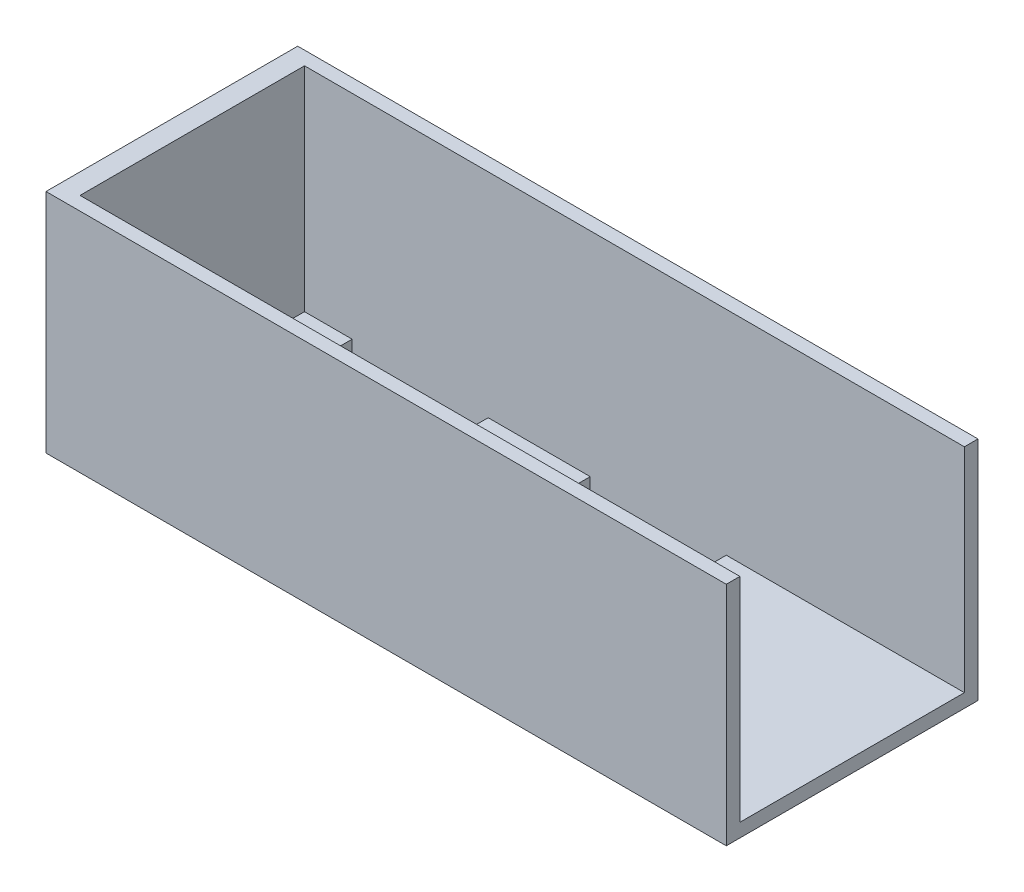
ISO-10303-21;
HEADER;
FILE_DESCRIPTION(('STEP AP214'),'2;1');
FILE_NAME('part.step','',(''),(''),'','','');
FILE_SCHEMA(('AUTOMOTIVE_DESIGN { 1 0 10303 214 1 1 1 1 }'));
ENDSEC;
DATA;
#1=APPLICATION_CONTEXT('core data for automotive mechanical design processes');
#2=APPLICATION_PROTOCOL_DEFINITION('international standard','automotive_design',2000,#1);
#3=PRODUCT_CONTEXT('',#1,'mechanical');
#4=PRODUCT('Part','Part','',(#3));
#5=PRODUCT_RELATED_PRODUCT_CATEGORY('part','',(#4));
#6=PRODUCT_DEFINITION_FORMATION('','',#4);
#7=PRODUCT_DEFINITION_CONTEXT('part definition',#1,'design');
#8=PRODUCT_DEFINITION('design','',#6,#7);
#9=PRODUCT_DEFINITION_SHAPE('','',#8);
#10=(LENGTH_UNIT() NAMED_UNIT(*) SI_UNIT(.MILLI.,.METRE.));
#11=(NAMED_UNIT(*) PLANE_ANGLE_UNIT() SI_UNIT($,.RADIAN.));
#12=(NAMED_UNIT(*) SI_UNIT($,.STERADIAN.) SOLID_ANGLE_UNIT());
#13=UNCERTAINTY_MEASURE_WITH_UNIT(LENGTH_MEASURE(1.E-05),#10,'distance_accuracy_value','');
#14=(GEOMETRIC_REPRESENTATION_CONTEXT(3) GLOBAL_UNCERTAINTY_ASSIGNED_CONTEXT((#13)) GLOBAL_UNIT_ASSIGNED_CONTEXT((#10,
#11,#12)) REPRESENTATION_CONTEXT('',''));
#15=CARTESIAN_POINT('',(0.,0.,0.));
#16=DIRECTION('',(0.,0.,1.));
#17=DIRECTION('',(1.,0.,0.));
#18=AXIS2_PLACEMENT_3D('',#15,#16,#17);
#19=CARTESIAN_POINT('',(50.,0.,-16.));
#20=DIRECTION('',(0.,0.,-1.));
#21=DIRECTION('',(0.,1.,0.));
#22=AXIS2_PLACEMENT_3D('',#19,#20,#21);
#23=PLANE('',#22);
#24=DIRECTION('',(-1.,0.,0.));
#25=VECTOR('',#24,1.);
#26=CARTESIAN_POINT('',(50.,0.,-16.));
#27=LINE('',#26,#25);
#28=CARTESIAN_POINT('',(50.,0.,-16.));
#29=VERTEX_POINT('',#28);
#30=CARTESIAN_POINT('',(-47.,0.,-16.));
#31=VERTEX_POINT('',#30);
#32=EDGE_CURVE('E336',#29,#31,#27,.T.);
#33=ORIENTED_EDGE('',*,*,#32,.T.);
#34=DIRECTION('',(0.,1.,0.));
#35=VECTOR('',#34,1.);
#36=CARTESIAN_POINT('',(-47.,0.,-16.));
#37=LINE('',#36,#35);
#38=CARTESIAN_POINT('',(-47.,-31.3,-16.));
#39=VERTEX_POINT('',#38);
#40=EDGE_CURVE('E293',#39,#31,#37,.T.);
#41=ORIENTED_EDGE('',*,*,#40,.F.);
#42=DIRECTION('',(-1.,0.,0.));
#43=VECTOR('',#42,1.);
#44=CARTESIAN_POINT('',(50.,-31.3,-16.));
#45=LINE('',#44,#43);
#46=CARTESIAN_POINT('',(-40.,-31.3,-16.));
#47=VERTEX_POINT('',#46);
#48=EDGE_CURVE('E331',#47,#39,#45,.T.);
#49=ORIENTED_EDGE('',*,*,#48,.F.);
#50=DIRECTION('',(0.,1.,0.));
#51=VECTOR('',#50,1.);
#52=CARTESIAN_POINT('',(-40.,-50.,-16.));
#53=LINE('',#52,#51);
#54=CARTESIAN_POINT('',(-40.,-33.3,-16.));
#55=VERTEX_POINT('',#54);
#56=EDGE_CURVE('E394',#55,#47,#53,.T.);
#57=ORIENTED_EDGE('',*,*,#56,.F.);
#58=DIRECTION('',(-1.,0.,0.));
#59=VECTOR('',#58,1.);
#60=CARTESIAN_POINT('',(50.,-33.3,-16.));
#61=LINE('',#60,#59);
#62=CARTESIAN_POINT('',(-20.,-33.3,-16.));
#63=VERTEX_POINT('',#62);
#64=EDGE_CURVE('E251',#63,#55,#61,.T.);
#65=ORIENTED_EDGE('',*,*,#64,.F.);
#66=DIRECTION('',(0.,1.,0.));
#67=VECTOR('',#66,1.);
#68=CARTESIAN_POINT('',(-20.,-50.,-16.));
#69=LINE('',#68,#67);
#70=CARTESIAN_POINT('',(-20.,-31.3,-16.));
#71=VERTEX_POINT('',#70);
#72=EDGE_CURVE('E365',#63,#71,#69,.T.);
#73=ORIENTED_EDGE('',*,*,#72,.T.);
#74=CARTESIAN_POINT('',(-4.99999999999999,-31.3,-16.));
#75=VERTEX_POINT('',#74);
#76=EDGE_CURVE('E337',#75,#71,#45,.T.);
#77=ORIENTED_EDGE('',*,*,#76,.F.);
#78=DIRECTION('',(0.,1.,0.));
#79=VECTOR('',#78,1.);
#80=CARTESIAN_POINT('',(-4.99999999999999,-50.,-16.));
#81=LINE('',#80,#79);
#82=CARTESIAN_POINT('',(-4.99999999999999,-33.3,-16.));
#83=VERTEX_POINT('',#82);
#84=EDGE_CURVE('E363',#83,#75,#81,.T.);
#85=ORIENTED_EDGE('',*,*,#84,.F.);
#86=DIRECTION('',(-1.,0.,0.));
#87=VECTOR('',#86,1.);
#88=CARTESIAN_POINT('',(50.,-33.3,-16.));
#89=LINE('',#88,#87);
#90=CARTESIAN_POINT('',(15.,-33.3,-16.));
#91=VERTEX_POINT('',#90);
#92=EDGE_CURVE('E236',#91,#83,#89,.T.);
#93=ORIENTED_EDGE('',*,*,#92,.F.);
#94=DIRECTION('',(0.,1.,0.));
#95=VECTOR('',#94,1.);
#96=CARTESIAN_POINT('',(15.,-50.,-16.));
#97=LINE('',#96,#95);
#98=CARTESIAN_POINT('',(15.,-31.3,-16.));
#99=VERTEX_POINT('',#98);
#100=EDGE_CURVE('E367',#91,#99,#97,.T.);
#101=ORIENTED_EDGE('',*,*,#100,.T.);
#102=CARTESIAN_POINT('',(50.,-31.3,-16.));
#103=VERTEX_POINT('',#102);
#104=EDGE_CURVE('E333',#103,#99,#45,.T.);
#105=ORIENTED_EDGE('',*,*,#104,.F.);
#106=DIRECTION('',(0.,-1.,0.));
#107=VECTOR('',#106,1.);
#108=CARTESIAN_POINT('',(50.,0.,-16.));
#109=LINE('',#108,#107);
#110=EDGE_CURVE('E309',#29,#103,#109,.T.);
#111=ORIENTED_EDGE('',*,*,#110,.F.);
#112=EDGE_LOOP('',(#33,#41,#49,#57,#65,#73,#77,#85,#93,#101,#105,#111));
#113=FACE_BOUND('',#112,.T.);
#114=ADVANCED_FACE('F34',(#113),#23,.F.);
#115=CARTESIAN_POINT('',(50.,-31.3,17.));
#116=DIRECTION('',(0.,-1.,0.));
#117=DIRECTION('',(0.,0.,-1.));
#118=AXIS2_PLACEMENT_3D('',#115,#116,#117);
#119=PLANE('',#118);
#120=DIRECTION('',(1.,0.,0.));
#121=VECTOR('',#120,1.);
#122=CARTESIAN_POINT('',(50.,-31.3,9.99999999999999));
#123=LINE('',#122,#121);
#124=CARTESIAN_POINT('',(-4.99999999999999,-31.3,10.));
#125=VERTEX_POINT('',#124);
#126=CARTESIAN_POINT('',(15.,-31.3,10.));
#127=VERTEX_POINT('',#126);
#128=EDGE_CURVE('E284',#125,#127,#123,.T.);
#129=ORIENTED_EDGE('',*,*,#128,.T.);
#130=DIRECTION('',(0.,0.,1.));
#131=VECTOR('',#130,1.);
#132=CARTESIAN_POINT('',(15.,-31.3,17.));
#133=LINE('',#132,#131);
#134=CARTESIAN_POINT('',(15.,-31.3,17.));
#135=VERTEX_POINT('',#134);
#136=EDGE_CURVE('E272',#127,#135,#133,.T.);
#137=ORIENTED_EDGE('',*,*,#136,.T.);
#138=DIRECTION('',(-1.,0.,0.));
#139=VECTOR('',#138,1.);
#140=CARTESIAN_POINT('',(50.,-31.3,17.));
#141=LINE('',#140,#139);
#142=CARTESIAN_POINT('',(50.,-31.3,17.));
#143=VERTEX_POINT('',#142);
#144=EDGE_CURVE('E328',#143,#135,#141,.T.);
#145=ORIENTED_EDGE('',*,*,#144,.F.);
#146=DIRECTION('',(0.,0.,1.));
#147=VECTOR('',#146,1.);
#148=CARTESIAN_POINT('',(50.,-31.3,17.));
#149=LINE('',#148,#147);
#150=EDGE_CURVE('E311',#103,#143,#149,.T.);
#151=ORIENTED_EDGE('',*,*,#150,.F.);
#152=ORIENTED_EDGE('',*,*,#104,.T.);
#153=DIRECTION('',(0.,0.,1.));
#154=VECTOR('',#153,1.);
#155=CARTESIAN_POINT('',(15.,-31.3,17.));
#156=LINE('',#155,#154);
#157=CARTESIAN_POINT('',(15.,-31.3,-9.));
#158=VERTEX_POINT('',#157);
#159=EDGE_CURVE('E233',#99,#158,#156,.T.);
#160=ORIENTED_EDGE('',*,*,#159,.T.);
#161=DIRECTION('',(-1.,0.,0.));
#162=VECTOR('',#161,1.);
#163=CARTESIAN_POINT('',(50.,-31.3,-9.));
#164=LINE('',#163,#162);
#165=CARTESIAN_POINT('',(-4.99999999999999,-31.3,-9.));
#166=VERTEX_POINT('',#165);
#167=EDGE_CURVE('E278',#158,#166,#164,.T.);
#168=ORIENTED_EDGE('',*,*,#167,.T.);
#169=DIRECTION('',(0.,0.,-1.));
#170=VECTOR('',#169,1.);
#171=CARTESIAN_POINT('',(-4.99999999999999,-31.3,17.));
#172=LINE('',#171,#170);
#173=EDGE_CURVE('E242',#166,#75,#172,.T.);
#174=ORIENTED_EDGE('',*,*,#173,.T.);
#175=ORIENTED_EDGE('',*,*,#76,.T.);
#176=DIRECTION('',(0.,0.,1.));
#177=VECTOR('',#176,1.);
#178=CARTESIAN_POINT('',(-20.,-31.3,17.));
#179=LINE('',#178,#177);
#180=CARTESIAN_POINT('',(-20.,-31.3,-9.));
#181=VERTEX_POINT('',#180);
#182=EDGE_CURVE('E248',#71,#181,#179,.T.);
#183=ORIENTED_EDGE('',*,*,#182,.T.);
#184=DIRECTION('',(-1.,0.,0.));
#185=VECTOR('',#184,1.);
#186=CARTESIAN_POINT('',(50.,-31.3,-9.));
#187=LINE('',#186,#185);
#188=CARTESIAN_POINT('',(-40.,-31.3,-9.));
#189=VERTEX_POINT('',#188);
#190=EDGE_CURVE('E281',#181,#189,#187,.T.);
#191=ORIENTED_EDGE('',*,*,#190,.T.);
#192=DIRECTION('',(0.,0.,-1.));
#193=VECTOR('',#192,1.);
#194=CARTESIAN_POINT('',(-40.,-31.3,17.));
#195=LINE('',#194,#193);
#196=EDGE_CURVE('E257',#189,#47,#195,.T.);
#197=ORIENTED_EDGE('',*,*,#196,.T.);
#198=ORIENTED_EDGE('',*,*,#48,.T.);
#199=DIRECTION('',(0.,0.,-1.));
#200=VECTOR('',#199,1.);
#201=CARTESIAN_POINT('',(-47.,-31.3,17.));
#202=LINE('',#201,#200);
#203=CARTESIAN_POINT('',(-47.,-31.3,17.));
#204=VERTEX_POINT('',#203);
#205=EDGE_CURVE('E290',#204,#39,#202,.T.);
#206=ORIENTED_EDGE('',*,*,#205,.F.);
#207=CARTESIAN_POINT('',(-40.,-31.3,17.));
#208=VERTEX_POINT('',#207);
#209=EDGE_CURVE('E327',#208,#204,#141,.T.);
#210=ORIENTED_EDGE('',*,*,#209,.F.);
#211=DIRECTION('',(0.,0.,-1.));
#212=VECTOR('',#211,1.);
#213=CARTESIAN_POINT('',(-40.,-31.3,17.));
#214=LINE('',#213,#212);
#215=CARTESIAN_POINT('',(-40.,-31.3,9.99999999999998));
#216=VERTEX_POINT('',#215);
#217=EDGE_CURVE('E215',#208,#216,#214,.T.);
#218=ORIENTED_EDGE('',*,*,#217,.T.);
#219=DIRECTION('',(1.,0.,0.));
#220=VECTOR('',#219,1.);
#221=CARTESIAN_POINT('',(50.,-31.3,9.99999999999998));
#222=LINE('',#221,#220);
#223=CARTESIAN_POINT('',(-20.,-31.3,9.99999999999998));
#224=VERTEX_POINT('',#223);
#225=EDGE_CURVE('E275',#216,#224,#222,.T.);
#226=ORIENTED_EDGE('',*,*,#225,.T.);
#227=DIRECTION('',(0.,0.,1.));
#228=VECTOR('',#227,1.);
#229=CARTESIAN_POINT('',(-20.,-31.3,17.));
#230=LINE('',#229,#228);
#231=CARTESIAN_POINT('',(-20.,-31.3,17.));
#232=VERTEX_POINT('',#231);
#233=EDGE_CURVE('E223',#224,#232,#230,.T.);
#234=ORIENTED_EDGE('',*,*,#233,.T.);
#235=CARTESIAN_POINT('',(-4.99999999999999,-31.3,17.));
#236=VERTEX_POINT('',#235);
#237=EDGE_CURVE('E332',#236,#232,#141,.T.);
#238=ORIENTED_EDGE('',*,*,#237,.F.);
#239=DIRECTION('',(0.,0.,-1.));
#240=VECTOR('',#239,1.);
#241=CARTESIAN_POINT('',(-4.99999999999999,-31.3,17.));
#242=LINE('',#241,#240);
#243=EDGE_CURVE('E263',#236,#125,#242,.T.);
#244=ORIENTED_EDGE('',*,*,#243,.T.);
#245=EDGE_LOOP('',(#129,#137,#145,#151,#152,#160,#168,#174,#175,#183,#191,#197,#198,#206,#210,
#218,#226,#234,#238,#244));
#246=FACE_BOUND('',#245,.T.);
#247=ADVANCED_FACE('F381',(#246),#119,.F.);
#248=CARTESIAN_POINT('',(50.,0.,17.));
#249=DIRECTION('',(0.,0.,1.));
#250=DIRECTION('',(0.,-1.,0.));
#251=AXIS2_PLACEMENT_3D('',#248,#249,#250);
#252=PLANE('',#251);
#253=DIRECTION('',(0.,-1.,0.));
#254=VECTOR('',#253,1.);
#255=CARTESIAN_POINT('',(-47.,0.,17.));
#256=LINE('',#255,#254);
#257=CARTESIAN_POINT('',(-47.,0.,17.));
#258=VERTEX_POINT('',#257);
#259=EDGE_CURVE('E347',#258,#204,#256,.T.);
#260=ORIENTED_EDGE('',*,*,#259,.F.);
#261=DIRECTION('',(-1.,0.,0.));
#262=VECTOR('',#261,1.);
#263=CARTESIAN_POINT('',(50.,0.,17.));
#264=LINE('',#263,#262);
#265=CARTESIAN_POINT('',(50.,0.,17.));
#266=VERTEX_POINT('',#265);
#267=EDGE_CURVE('E315',#266,#258,#264,.T.);
#268=ORIENTED_EDGE('',*,*,#267,.F.);
#269=DIRECTION('',(0.,1.,0.));
#270=VECTOR('',#269,1.);
#271=CARTESIAN_POINT('',(50.,0.,17.));
#272=LINE('',#271,#270);
#273=EDGE_CURVE('E313',#143,#266,#272,.T.);
#274=ORIENTED_EDGE('',*,*,#273,.F.);
#275=ORIENTED_EDGE('',*,*,#144,.T.);
#276=DIRECTION('',(0.,1.,0.));
#277=VECTOR('',#276,1.);
#278=CARTESIAN_POINT('',(15.,-50.,17.));
#279=LINE('',#278,#277);
#280=CARTESIAN_POINT('',(15.,-33.3,17.));
#281=VERTEX_POINT('',#280);
#282=EDGE_CURVE('E217',#281,#135,#279,.T.);
#283=ORIENTED_EDGE('',*,*,#282,.F.);
#284=DIRECTION('',(1.,0.,0.));
#285=VECTOR('',#284,1.);
#286=CARTESIAN_POINT('',(50.,-33.3,17.));
#287=LINE('',#286,#285);
#288=CARTESIAN_POINT('',(-4.99999999999999,-33.3,17.));
#289=VERTEX_POINT('',#288);
#290=EDGE_CURVE('E266',#289,#281,#287,.T.);
#291=ORIENTED_EDGE('',*,*,#290,.F.);
#292=DIRECTION('',(0.,1.,0.));
#293=VECTOR('',#292,1.);
#294=CARTESIAN_POINT('',(-4.99999999999999,-50.,17.));
#295=LINE('',#294,#293);
#296=EDGE_CURVE('E386',#289,#236,#295,.T.);
#297=ORIENTED_EDGE('',*,*,#296,.T.);
#298=ORIENTED_EDGE('',*,*,#237,.T.);
#299=DIRECTION('',(0.,1.,0.));
#300=VECTOR('',#299,1.);
#301=CARTESIAN_POINT('',(-20.,-50.,17.));
#302=LINE('',#301,#300);
#303=CARTESIAN_POINT('',(-20.,-33.3,17.));
#304=VERTEX_POINT('',#303);
#305=EDGE_CURVE('E201',#304,#232,#302,.T.);
#306=ORIENTED_EDGE('',*,*,#305,.F.);
#307=DIRECTION('',(1.,0.,0.));
#308=VECTOR('',#307,1.);
#309=CARTESIAN_POINT('',(50.,-33.3,17.));
#310=LINE('',#309,#308);
#311=CARTESIAN_POINT('',(-40.,-33.3,17.));
#312=VERTEX_POINT('',#311);
#313=EDGE_CURVE('E194',#312,#304,#310,.T.);
#314=ORIENTED_EDGE('',*,*,#313,.F.);
#315=DIRECTION('',(0.,1.,0.));
#316=VECTOR('',#315,1.);
#317=CARTESIAN_POINT('',(-40.,-50.,17.));
#318=LINE('',#317,#316);
#319=EDGE_CURVE('E198',#312,#208,#318,.T.);
#320=ORIENTED_EDGE('',*,*,#319,.T.);
#321=ORIENTED_EDGE('',*,*,#209,.T.);
#322=EDGE_LOOP('',(#260,#268,#274,#275,#283,#291,#297,#298,#306,#314,#320,#321));
#323=FACE_BOUND('',#322,.T.);
#324=ADVANCED_FACE('F197',(#323),#252,.F.);
#325=CARTESIAN_POINT('',(50.,0.,19.));
#326=DIRECTION('',(0.,0.,-1.));
#327=DIRECTION('',(0.,1.,0.));
#328=AXIS2_PLACEMENT_3D('',#325,#326,#327);
#329=PLANE('',#328);
#330=DIRECTION('',(0.,-1.,0.));
#331=VECTOR('',#330,1.);
#332=CARTESIAN_POINT('',(-50.,0.,19.));
#333=LINE('',#332,#331);
#334=CARTESIAN_POINT('',(-50.,0.,19.));
#335=VERTEX_POINT('',#334);
#336=CARTESIAN_POINT('',(-50.,-33.3,19.));
#337=VERTEX_POINT('',#336);
#338=EDGE_CURVE('E296',#335,#337,#333,.T.);
#339=ORIENTED_EDGE('',*,*,#338,.T.);
#340=DIRECTION('',(-1.,0.,0.));
#341=VECTOR('',#340,1.);
#342=CARTESIAN_POINT('',(50.,-33.3,19.));
#343=LINE('',#342,#341);
#344=CARTESIAN_POINT('',(50.,-33.3,19.));
#345=VERTEX_POINT('',#344);
#346=EDGE_CURVE('E343',#345,#337,#343,.T.);
#347=ORIENTED_EDGE('',*,*,#346,.F.);
#348=DIRECTION('',(0.,-1.,0.));
#349=VECTOR('',#348,1.);
#350=CARTESIAN_POINT('',(50.,0.,19.));
#351=LINE('',#350,#349);
#352=CARTESIAN_POINT('',(50.,0.,19.));
#353=VERTEX_POINT('',#352);
#354=EDGE_CURVE('E300',#353,#345,#351,.T.);
#355=ORIENTED_EDGE('',*,*,#354,.F.);
#356=DIRECTION('',(-1.,0.,0.));
#357=VECTOR('',#356,1.);
#358=CARTESIAN_POINT('',(50.,0.,19.));
#359=LINE('',#358,#357);
#360=EDGE_CURVE('E345',#353,#335,#359,.T.);
#361=ORIENTED_EDGE('',*,*,#360,.T.);
#362=EDGE_LOOP('',(#339,#347,#355,#361));
#363=FACE_BOUND('',#362,.T.);
#364=ADVANCED_FACE('F36',(#363),#329,.F.);
#365=CARTESIAN_POINT('',(50.,-33.3,19.));
#366=DIRECTION('',(0.,1.,0.));
#367=DIRECTION('',(0.,0.,1.));
#368=AXIS2_PLACEMENT_3D('',#365,#366,#367);
#369=PLANE('',#368);
#370=ORIENTED_EDGE('',*,*,#290,.T.);
#371=DIRECTION('',(0.,0.,-1.));
#372=VECTOR('',#371,1.);
#373=CARTESIAN_POINT('',(15.,-33.3,19.));
#374=LINE('',#373,#372);
#375=CARTESIAN_POINT('',(15.,-33.3,10.));
#376=VERTEX_POINT('',#375);
#377=EDGE_CURVE('E269',#281,#376,#374,.T.);
#378=ORIENTED_EDGE('',*,*,#377,.T.);
#379=DIRECTION('',(-1.,0.,0.));
#380=VECTOR('',#379,1.);
#381=CARTESIAN_POINT('',(50.,-33.3,10.));
#382=LINE('',#381,#380);
#383=CARTESIAN_POINT('',(-4.99999999999999,-33.3,10.));
#384=VERTEX_POINT('',#383);
#385=EDGE_CURVE('E11',#376,#384,#382,.T.);
#386=ORIENTED_EDGE('',*,*,#385,.T.);
#387=DIRECTION('',(0.,0.,1.));
#388=VECTOR('',#387,1.);
#389=CARTESIAN_POINT('',(-4.99999999999999,-33.3,19.));
#390=LINE('',#389,#388);
#391=EDGE_CURVE('E260',#384,#289,#390,.T.);
#392=ORIENTED_EDGE('',*,*,#391,.T.);
#393=EDGE_LOOP('',(#370,#378,#386,#392));
#394=FACE_BOUND('',#393,.T.);
#395=ORIENTED_EDGE('',*,*,#64,.T.);
#396=DIRECTION('',(0.,0.,1.));
#397=VECTOR('',#396,1.);
#398=CARTESIAN_POINT('',(-40.,-33.3,19.));
#399=LINE('',#398,#397);
#400=CARTESIAN_POINT('',(-40.,-33.3,-9.));
#401=VERTEX_POINT('',#400);
#402=EDGE_CURVE('E254',#55,#401,#399,.T.);
#403=ORIENTED_EDGE('',*,*,#402,.T.);
#404=DIRECTION('',(1.,0.,0.));
#405=VECTOR('',#404,1.);
#406=CARTESIAN_POINT('',(50.,-33.3,-9.));
#407=LINE('',#406,#405);
#408=CARTESIAN_POINT('',(-20.,-33.3,-9.));
#409=VERTEX_POINT('',#408);
#410=EDGE_CURVE('E42',#401,#409,#407,.T.);
#411=ORIENTED_EDGE('',*,*,#410,.T.);
#412=DIRECTION('',(0.,0.,-1.));
#413=VECTOR('',#412,1.);
#414=CARTESIAN_POINT('',(-20.,-33.3,19.));
#415=LINE('',#414,#413);
#416=EDGE_CURVE('E245',#409,#63,#415,.T.);
#417=ORIENTED_EDGE('',*,*,#416,.T.);
#418=EDGE_LOOP('',(#395,#403,#411,#417));
#419=FACE_BOUND('',#418,.T.);
#420=ORIENTED_EDGE('',*,*,#92,.T.);
#421=DIRECTION('',(0.,0.,1.));
#422=VECTOR('',#421,1.);
#423=CARTESIAN_POINT('',(-4.99999999999999,-33.3,19.));
#424=LINE('',#423,#422);
#425=CARTESIAN_POINT('',(-4.99999999999999,-33.3,-9.));
#426=VERTEX_POINT('',#425);
#427=EDGE_CURVE('E239',#83,#426,#424,.T.);
#428=ORIENTED_EDGE('',*,*,#427,.T.);
#429=DIRECTION('',(1.,0.,0.));
#430=VECTOR('',#429,1.);
#431=CARTESIAN_POINT('',(50.,-33.3,-9.));
#432=LINE('',#431,#430);
#433=CARTESIAN_POINT('',(15.,-33.3,-9.));
#434=VERTEX_POINT('',#433);
#435=EDGE_CURVE('E351',#426,#434,#432,.T.);
#436=ORIENTED_EDGE('',*,*,#435,.T.);
#437=DIRECTION('',(0.,0.,-1.));
#438=VECTOR('',#437,1.);
#439=CARTESIAN_POINT('',(15.,-33.3,19.));
#440=LINE('',#439,#438);
#441=EDGE_CURVE('E225',#434,#91,#440,.T.);
#442=ORIENTED_EDGE('',*,*,#441,.T.);
#443=EDGE_LOOP('',(#420,#428,#436,#442));
#444=FACE_BOUND('',#443,.T.);
#445=DIRECTION('',(-1.,0.,0.));
#446=VECTOR('',#445,1.);
#447=CARTESIAN_POINT('',(50.,-33.3,9.99999999999998));
#448=LINE('',#447,#446);
#449=CARTESIAN_POINT('',(-20.,-33.3,9.99999999999998));
#450=VERTEX_POINT('',#449);
#451=CARTESIAN_POINT('',(-40.,-33.3,9.99999999999998));
#452=VERTEX_POINT('',#451);
#453=EDGE_CURVE('E222',#450,#452,#448,.T.);
#454=ORIENTED_EDGE('',*,*,#453,.T.);
#455=DIRECTION('',(0.,0.,1.));
#456=VECTOR('',#455,1.);
#457=CARTESIAN_POINT('',(-40.,-33.3,19.));
#458=LINE('',#457,#456);
#459=EDGE_CURVE('E212',#452,#312,#458,.T.);
#460=ORIENTED_EDGE('',*,*,#459,.T.);
#461=ORIENTED_EDGE('',*,*,#313,.T.);
#462=DIRECTION('',(0.,0.,-1.));
#463=VECTOR('',#462,1.);
#464=CARTESIAN_POINT('',(-20.,-33.3,19.));
#465=LINE('',#464,#463);
#466=EDGE_CURVE('E206',#304,#450,#465,.T.);
#467=ORIENTED_EDGE('',*,*,#466,.T.);
#468=EDGE_LOOP('',(#454,#460,#461,#467));
#469=FACE_BOUND('',#468,.T.);
#470=DIRECTION('',(0.,0.,-1.));
#471=VECTOR('',#470,1.);
#472=CARTESIAN_POINT('',(-50.,-33.3,19.));
#473=LINE('',#472,#471);
#474=CARTESIAN_POINT('',(-50.,-33.3,-18.));
#475=VERTEX_POINT('',#474);
#476=EDGE_CURVE('E318',#337,#475,#473,.T.);
#477=ORIENTED_EDGE('',*,*,#476,.T.);
#478=DIRECTION('',(-1.,0.,0.));
#479=VECTOR('',#478,1.);
#480=CARTESIAN_POINT('',(50.,-33.3,-18.));
#481=LINE('',#480,#479);
#482=CARTESIAN_POINT('',(50.,-33.3,-18.));
#483=VERTEX_POINT('',#482);
#484=EDGE_CURVE('E341',#483,#475,#481,.T.);
#485=ORIENTED_EDGE('',*,*,#484,.F.);
#486=DIRECTION('',(0.,0.,-1.));
#487=VECTOR('',#486,1.);
#488=CARTESIAN_POINT('',(50.,-33.3,19.));
#489=LINE('',#488,#487);
#490=EDGE_CURVE('E303',#345,#483,#489,.T.);
#491=ORIENTED_EDGE('',*,*,#490,.F.);
#492=ORIENTED_EDGE('',*,*,#346,.T.);
#493=EDGE_LOOP('',(#477,#485,#491,#492));
#494=FACE_BOUND('',#493,.T.);
#495=ADVANCED_FACE('F220',(#394,#419,#444,#469,#494),#369,.F.);
#496=CARTESIAN_POINT('',(50.,-33.3,-18.));
#497=DIRECTION('',(0.,0.,1.));
#498=DIRECTION('',(1.,0.,0.));
#499=AXIS2_PLACEMENT_3D('',#496,#497,#498);
#500=PLANE('',#499);
#501=DIRECTION('',(0.,1.,0.));
#502=VECTOR('',#501,1.);
#503=CARTESIAN_POINT('',(-50.,-33.3,-18.));
#504=LINE('',#503,#502);
#505=CARTESIAN_POINT('',(-50.,0.,-18.));
#506=VERTEX_POINT('',#505);
#507=EDGE_CURVE('E321',#475,#506,#504,.T.);
#508=ORIENTED_EDGE('',*,*,#507,.T.);
#509=DIRECTION('',(-1.,0.,0.));
#510=VECTOR('',#509,1.);
#511=CARTESIAN_POINT('',(50.,0.,-18.));
#512=LINE('',#511,#510);
#513=CARTESIAN_POINT('',(50.,0.,-18.));
#514=VERTEX_POINT('',#513);
#515=EDGE_CURVE('E339',#514,#506,#512,.T.);
#516=ORIENTED_EDGE('',*,*,#515,.F.);
#517=DIRECTION('',(0.,1.,0.));
#518=VECTOR('',#517,1.);
#519=CARTESIAN_POINT('',(50.,-33.3,-18.));
#520=LINE('',#519,#518);
#521=EDGE_CURVE('E305',#483,#514,#520,.T.);
#522=ORIENTED_EDGE('',*,*,#521,.F.);
#523=ORIENTED_EDGE('',*,*,#484,.T.);
#524=EDGE_LOOP('',(#508,#516,#522,#523));
#525=FACE_BOUND('',#524,.T.);
#526=ADVANCED_FACE('F450',(#525),#500,.F.);
#527=CARTESIAN_POINT('',(50.,0.,-16.));
#528=DIRECTION('',(0.,-1.,0.));
#529=DIRECTION('',(0.,0.,-1.));
#530=AXIS2_PLACEMENT_3D('',#527,#528,#529);
#531=PLANE('',#530);
#532=DIRECTION('',(0.,0.,1.));
#533=VECTOR('',#532,1.);
#534=CARTESIAN_POINT('',(-50.,0.,-16.));
#535=LINE('',#534,#533);
#536=EDGE_CURVE('E301',#506,#335,#535,.T.);
#537=ORIENTED_EDGE('',*,*,#536,.T.);
#538=ORIENTED_EDGE('',*,*,#360,.F.);
#539=DIRECTION('',(0.,0.,1.));
#540=VECTOR('',#539,1.);
#541=CARTESIAN_POINT('',(50.,0.,19.));
#542=LINE('',#541,#540);
#543=EDGE_CURVE('E297',#266,#353,#542,.T.);
#544=ORIENTED_EDGE('',*,*,#543,.F.);
#545=ORIENTED_EDGE('',*,*,#267,.T.);
#546=DIRECTION('',(0.,0.,-1.));
#547=VECTOR('',#546,1.);
#548=CARTESIAN_POINT('',(-47.,0.,-18.));
#549=LINE('',#548,#547);
#550=EDGE_CURVE('E287',#258,#31,#549,.T.);
#551=ORIENTED_EDGE('',*,*,#550,.T.);
#552=ORIENTED_EDGE('',*,*,#32,.F.);
#553=DIRECTION('',(0.,0.,1.));
#554=VECTOR('',#553,1.);
#555=CARTESIAN_POINT('',(50.,0.,-16.));
#556=LINE('',#555,#554);
#557=EDGE_CURVE('E307',#514,#29,#556,.T.);
#558=ORIENTED_EDGE('',*,*,#557,.F.);
#559=ORIENTED_EDGE('',*,*,#515,.T.);
#560=EDGE_LOOP('',(#537,#538,#544,#545,#551,#552,#558,#559));
#561=FACE_BOUND('',#560,.T.);
#562=ADVANCED_FACE('F418',(#561),#531,.F.);
#563=CARTESIAN_POINT('',(50.,0.,0.));
#564=DIRECTION('',(-1.,0.,0.));
#565=DIRECTION('',(0.,0.,1.));
#566=AXIS2_PLACEMENT_3D('',#563,#564,#565);
#567=PLANE('',#566);
#568=ORIENTED_EDGE('',*,*,#543,.T.);
#569=ORIENTED_EDGE('',*,*,#354,.T.);
#570=ORIENTED_EDGE('',*,*,#490,.T.);
#571=ORIENTED_EDGE('',*,*,#521,.T.);
#572=ORIENTED_EDGE('',*,*,#557,.T.);
#573=ORIENTED_EDGE('',*,*,#110,.T.);
#574=ORIENTED_EDGE('',*,*,#150,.T.);
#575=ORIENTED_EDGE('',*,*,#273,.T.);
#576=EDGE_LOOP('',(#568,#569,#570,#571,#572,#573,#574,#575));
#577=FACE_BOUND('',#576,.T.);
#578=ADVANCED_FACE('F420',(#577),#567,.F.);
#579=CARTESIAN_POINT('',(-50.,0.,0.));
#580=DIRECTION('',(-1.,0.,0.));
#581=DIRECTION('',(0.,0.,1.));
#582=AXIS2_PLACEMENT_3D('',#579,#580,#581);
#583=PLANE('',#582);
#584=ORIENTED_EDGE('',*,*,#338,.F.);
#585=ORIENTED_EDGE('',*,*,#536,.F.);
#586=ORIENTED_EDGE('',*,*,#507,.F.);
#587=ORIENTED_EDGE('',*,*,#476,.F.);
#588=EDGE_LOOP('',(#584,#585,#586,#587));
#589=FACE_BOUND('',#588,.T.);
#590=ADVANCED_FACE('F467',(#589),#583,.T.);
#591=CARTESIAN_POINT('',(-47.,0.,0.));
#592=DIRECTION('',(-1.,0.,0.));
#593=DIRECTION('',(0.,0.,1.));
#594=AXIS2_PLACEMENT_3D('',#591,#592,#593);
#595=PLANE('',#594);
#596=ORIENTED_EDGE('',*,*,#205,.T.);
#597=ORIENTED_EDGE('',*,*,#40,.T.);
#598=ORIENTED_EDGE('',*,*,#550,.F.);
#599=ORIENTED_EDGE('',*,*,#259,.T.);
#600=EDGE_LOOP('',(#596,#597,#598,#599));
#601=FACE_BOUND('',#600,.T.);
#602=ADVANCED_FACE('F412',(#601),#595,.F.);
#603=CARTESIAN_POINT('',(-40.,-50.,9.99999999999998));
#604=DIRECTION('',(0.,0.,-1.));
#605=DIRECTION('',(-1.,0.,0.));
#606=AXIS2_PLACEMENT_3D('',#603,#604,#605);
#607=PLANE('',#606);
#608=DIRECTION('',(0.,1.,0.));
#609=VECTOR('',#608,1.);
#610=CARTESIAN_POINT('',(-40.,-50.,9.99999999999998));
#611=LINE('',#610,#609);
#612=EDGE_CURVE('E207',#452,#216,#611,.T.);
#613=ORIENTED_EDGE('',*,*,#612,.F.);
#614=ORIENTED_EDGE('',*,*,#453,.F.);
#615=DIRECTION('',(0.,1.,0.));
#616=VECTOR('',#615,1.);
#617=CARTESIAN_POINT('',(-20.,-50.,9.99999999999998));
#618=LINE('',#617,#616);
#619=EDGE_CURVE('E372',#450,#224,#618,.T.);
#620=ORIENTED_EDGE('',*,*,#619,.T.);
#621=ORIENTED_EDGE('',*,*,#225,.F.);
#622=EDGE_LOOP('',(#613,#614,#620,#621));
#623=FACE_BOUND('',#622,.T.);
#624=ADVANCED_FACE('F379',(#623),#607,.F.);
#625=CARTESIAN_POINT('',(-40.,-50.,17.));
#626=DIRECTION('',(-1.,0.,0.));
#627=DIRECTION('',(0.,0.,1.));
#628=AXIS2_PLACEMENT_3D('',#625,#626,#627);
#629=PLANE('',#628);
#630=ORIENTED_EDGE('',*,*,#319,.F.);
#631=ORIENTED_EDGE('',*,*,#459,.F.);
#632=ORIENTED_EDGE('',*,*,#612,.T.);
#633=ORIENTED_EDGE('',*,*,#217,.F.);
#634=EDGE_LOOP('',(#630,#631,#632,#633));
#635=FACE_BOUND('',#634,.T.);
#636=ADVANCED_FACE('F210',(#635),#629,.F.);
#637=CARTESIAN_POINT('',(-20.,-50.,17.));
#638=DIRECTION('',(1.,0.,0.));
#639=DIRECTION('',(0.,0.,-1.));
#640=AXIS2_PLACEMENT_3D('',#637,#638,#639);
#641=PLANE('',#640);
#642=ORIENTED_EDGE('',*,*,#619,.F.);
#643=ORIENTED_EDGE('',*,*,#466,.F.);
#644=ORIENTED_EDGE('',*,*,#305,.T.);
#645=ORIENTED_EDGE('',*,*,#233,.F.);
#646=EDGE_LOOP('',(#642,#643,#644,#645));
#647=FACE_BOUND('',#646,.T.);
#648=ADVANCED_FACE('F377',(#647),#641,.F.);
#649=CARTESIAN_POINT('',(-4.99999999999999,-50.,-9.));
#650=DIRECTION('',(0.,0.,1.));
#651=DIRECTION('',(1.,0.,0.));
#652=AXIS2_PLACEMENT_3D('',#649,#650,#651);
#653=PLANE('',#652);
#654=DIRECTION('',(0.,1.,0.));
#655=VECTOR('',#654,1.);
#656=CARTESIAN_POINT('',(15.,-50.,-9.));
#657=LINE('',#656,#655);
#658=EDGE_CURVE('E478',#434,#158,#657,.T.);
#659=ORIENTED_EDGE('',*,*,#658,.F.);
#660=ORIENTED_EDGE('',*,*,#435,.F.);
#661=DIRECTION('',(0.,1.,0.));
#662=VECTOR('',#661,1.);
#663=CARTESIAN_POINT('',(-4.99999999999999,-50.,-9.));
#664=LINE('',#663,#662);
#665=EDGE_CURVE('E480',#426,#166,#664,.T.);
#666=ORIENTED_EDGE('',*,*,#665,.T.);
#667=ORIENTED_EDGE('',*,*,#167,.F.);
#668=EDGE_LOOP('',(#659,#660,#666,#667));
#669=FACE_BOUND('',#668,.T.);
#670=ADVANCED_FACE('F485',(#669),#653,.F.);
#671=CARTESIAN_POINT('',(-4.99999999999999,-50.,-9.));
#672=DIRECTION('',(-1.,0.,0.));
#673=DIRECTION('',(0.,0.,1.));
#674=AXIS2_PLACEMENT_3D('',#671,#672,#673);
#675=PLANE('',#674);
#676=ORIENTED_EDGE('',*,*,#665,.F.);
#677=ORIENTED_EDGE('',*,*,#427,.F.);
#678=ORIENTED_EDGE('',*,*,#84,.T.);
#679=ORIENTED_EDGE('',*,*,#173,.F.);
#680=EDGE_LOOP('',(#676,#677,#678,#679));
#681=FACE_BOUND('',#680,.T.);
#682=ADVANCED_FACE('F487',(#681),#675,.F.);
#683=CARTESIAN_POINT('',(15.,-50.,-9.));
#684=DIRECTION('',(1.,0.,0.));
#685=DIRECTION('',(0.,0.,-1.));
#686=AXIS2_PLACEMENT_3D('',#683,#684,#685);
#687=PLANE('',#686);
#688=ORIENTED_EDGE('',*,*,#100,.F.);
#689=ORIENTED_EDGE('',*,*,#441,.F.);
#690=ORIENTED_EDGE('',*,*,#658,.T.);
#691=ORIENTED_EDGE('',*,*,#159,.F.);
#692=EDGE_LOOP('',(#688,#689,#690,#691));
#693=FACE_BOUND('',#692,.T.);
#694=ADVANCED_FACE('F476',(#693),#687,.F.);
#695=CARTESIAN_POINT('',(-40.,-50.,-9.));
#696=DIRECTION('',(0.,0.,1.));
#697=DIRECTION('',(1.,0.,0.));
#698=AXIS2_PLACEMENT_3D('',#695,#696,#697);
#699=PLANE('',#698);
#700=DIRECTION('',(0.,1.,0.));
#701=VECTOR('',#700,1.);
#702=CARTESIAN_POINT('',(-20.,-50.,-9.));
#703=LINE('',#702,#701);
#704=EDGE_CURVE('E359',#409,#181,#703,.T.);
#705=ORIENTED_EDGE('',*,*,#704,.F.);
#706=ORIENTED_EDGE('',*,*,#410,.F.);
#707=DIRECTION('',(0.,1.,0.));
#708=VECTOR('',#707,1.);
#709=CARTESIAN_POINT('',(-40.,-50.,-9.));
#710=LINE('',#709,#708);
#711=EDGE_CURVE('E57',#401,#189,#710,.T.);
#712=ORIENTED_EDGE('',*,*,#711,.T.);
#713=ORIENTED_EDGE('',*,*,#190,.F.);
#714=EDGE_LOOP('',(#705,#706,#712,#713));
#715=FACE_BOUND('',#714,.T.);
#716=ADVANCED_FACE('F357',(#715),#699,.F.);
#717=CARTESIAN_POINT('',(-40.,-50.,-16.));
#718=DIRECTION('',(-1.,0.,0.));
#719=DIRECTION('',(0.,0.,1.));
#720=AXIS2_PLACEMENT_3D('',#717,#718,#719);
#721=PLANE('',#720);
#722=ORIENTED_EDGE('',*,*,#711,.F.);
#723=ORIENTED_EDGE('',*,*,#402,.F.);
#724=ORIENTED_EDGE('',*,*,#56,.T.);
#725=ORIENTED_EDGE('',*,*,#196,.F.);
#726=EDGE_LOOP('',(#722,#723,#724,#725));
#727=FACE_BOUND('',#726,.T.);
#728=ADVANCED_FACE('F361',(#727),#721,.F.);
#729=CARTESIAN_POINT('',(-20.,-50.,-16.));
#730=DIRECTION('',(1.,0.,0.));
#731=DIRECTION('',(0.,0.,-1.));
#732=AXIS2_PLACEMENT_3D('',#729,#730,#731);
#733=PLANE('',#732);
#734=ORIENTED_EDGE('',*,*,#72,.F.);
#735=ORIENTED_EDGE('',*,*,#416,.F.);
#736=ORIENTED_EDGE('',*,*,#704,.T.);
#737=ORIENTED_EDGE('',*,*,#182,.F.);
#738=EDGE_LOOP('',(#734,#735,#736,#737));
#739=FACE_BOUND('',#738,.T.);
#740=ADVANCED_FACE('F437',(#739),#733,.F.);
#741=CARTESIAN_POINT('',(15.,-50.,10.));
#742=DIRECTION('',(0.,0.,-1.));
#743=DIRECTION('',(-1.,0.,0.));
#744=AXIS2_PLACEMENT_3D('',#741,#742,#743);
#745=PLANE('',#744);
#746=DIRECTION('',(0.,1.,0.));
#747=VECTOR('',#746,1.);
#748=CARTESIAN_POINT('',(-4.99999999999999,-50.,10.));
#749=LINE('',#748,#747);
#750=EDGE_CURVE('E391',#384,#125,#749,.T.);
#751=ORIENTED_EDGE('',*,*,#750,.F.);
#752=ORIENTED_EDGE('',*,*,#385,.F.);
#753=DIRECTION('',(0.,1.,0.));
#754=VECTOR('',#753,1.);
#755=CARTESIAN_POINT('',(15.,-50.,10.));
#756=LINE('',#755,#754);
#757=EDGE_CURVE('E49',#376,#127,#756,.T.);
#758=ORIENTED_EDGE('',*,*,#757,.T.);
#759=ORIENTED_EDGE('',*,*,#128,.F.);
#760=EDGE_LOOP('',(#751,#752,#758,#759));
#761=FACE_BOUND('',#760,.T.);
#762=ADVANCED_FACE('F428',(#761),#745,.F.);
#763=CARTESIAN_POINT('',(15.,-50.,17.));
#764=DIRECTION('',(1.,0.,0.));
#765=DIRECTION('',(0.,0.,-1.));
#766=AXIS2_PLACEMENT_3D('',#763,#764,#765);
#767=PLANE('',#766);
#768=ORIENTED_EDGE('',*,*,#757,.F.);
#769=ORIENTED_EDGE('',*,*,#377,.F.);
#770=ORIENTED_EDGE('',*,*,#282,.T.);
#771=ORIENTED_EDGE('',*,*,#136,.F.);
#772=EDGE_LOOP('',(#768,#769,#770,#771));
#773=FACE_BOUND('',#772,.T.);
#774=ADVANCED_FACE('F429',(#773),#767,.F.);
#775=CARTESIAN_POINT('',(-4.99999999999999,-50.,17.));
#776=DIRECTION('',(-1.,0.,0.));
#777=DIRECTION('',(0.,0.,1.));
#778=AXIS2_PLACEMENT_3D('',#775,#776,#777);
#779=PLANE('',#778);
#780=ORIENTED_EDGE('',*,*,#296,.F.);
#781=ORIENTED_EDGE('',*,*,#391,.F.);
#782=ORIENTED_EDGE('',*,*,#750,.T.);
#783=ORIENTED_EDGE('',*,*,#243,.F.);
#784=EDGE_LOOP('',(#780,#781,#782,#783));
#785=FACE_BOUND('',#784,.T.);
#786=ADVANCED_FACE('F389',(#785),#779,.F.);
#787=CLOSED_SHELL('',(#114,#247,#324,#364,#495,#526,#562,#578,#590,#602,#624,#636,#648,#670,
#682,#694,#716,#728,#740,#762,#774,#786));
#788=MANIFOLD_SOLID_BREP('B2',#787);
#789=ADVANCED_BREP_SHAPE_REPRESENTATION('',(#18,#788),#14);
#790=SHAPE_DEFINITION_REPRESENTATION(#9,#789);
ENDSEC;
END-ISO-10303-21;
